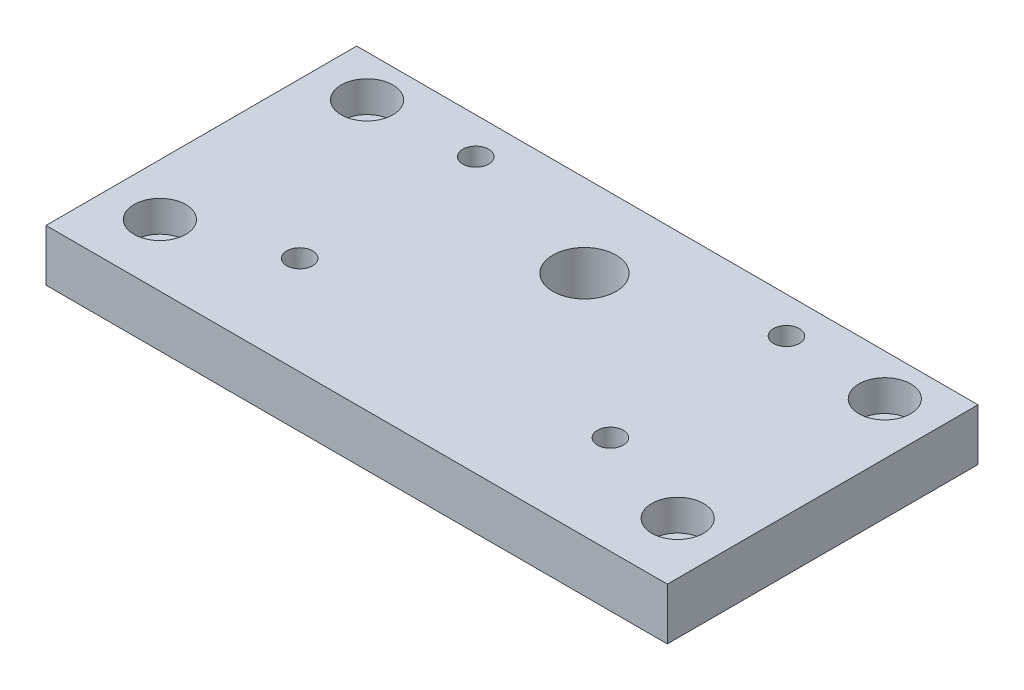
ISO-10303-21;
HEADER;
FILE_DESCRIPTION(('STEP AP214'),'2;1');
FILE_NAME('part.step','',(''),(''),'','','');
FILE_SCHEMA(('AUTOMOTIVE_DESIGN { 1 0 10303 214 1 1 1 1 }'));
ENDSEC;
DATA;
#1=APPLICATION_CONTEXT('core data for automotive mechanical design processes');
#2=APPLICATION_PROTOCOL_DEFINITION('international standard','automotive_design',2000,#1);
#3=PRODUCT_CONTEXT('',#1,'mechanical');
#4=PRODUCT('Part','Part','',(#3));
#5=PRODUCT_RELATED_PRODUCT_CATEGORY('part','',(#4));
#6=PRODUCT_DEFINITION_FORMATION('','',#4);
#7=PRODUCT_DEFINITION_CONTEXT('part definition',#1,'design');
#8=PRODUCT_DEFINITION('design','',#6,#7);
#9=PRODUCT_DEFINITION_SHAPE('','',#8);
#10=(LENGTH_UNIT() NAMED_UNIT(*) SI_UNIT(.MILLI.,.METRE.));
#11=(NAMED_UNIT(*) PLANE_ANGLE_UNIT() SI_UNIT($,.RADIAN.));
#12=(NAMED_UNIT(*) SI_UNIT($,.STERADIAN.) SOLID_ANGLE_UNIT());
#13=UNCERTAINTY_MEASURE_WITH_UNIT(LENGTH_MEASURE(1.E-05),#10,'distance_accuracy_value','');
#14=(GEOMETRIC_REPRESENTATION_CONTEXT(3) GLOBAL_UNCERTAINTY_ASSIGNED_CONTEXT((#13)) GLOBAL_UNIT_ASSIGNED_CONTEXT((#10,
#11,#12)) REPRESENTATION_CONTEXT('',''));
#15=CARTESIAN_POINT('',(0.,0.,0.));
#16=DIRECTION('',(0.,0.,1.));
#17=DIRECTION('',(1.,0.,0.));
#18=AXIS2_PLACEMENT_3D('',#15,#16,#17);
#19=CARTESIAN_POINT('',(5.,0.,-6.));
#20=DIRECTION('',(0.,1.,0.));
#21=DIRECTION('',(0.,0.,1.));
#22=AXIS2_PLACEMENT_3D('',#19,#20,#21);
#23=CYLINDRICAL_SURFACE('',#22,1.25);
#24=CARTESIAN_POINT('',(5.,0.,-6.));
#25=DIRECTION('',(0.,-1.,0.));
#26=DIRECTION('',(0.,0.,1.));
#27=AXIS2_PLACEMENT_3D('',#24,#25,#26);
#28=CIRCLE('',#27,1.25);
#29=CARTESIAN_POINT('',(5.,0.,-4.74999999999999));
#30=VERTEX_POINT('',#29);
#31=EDGE_CURVE('E115',#30,#30,#28,.T.);
#32=ORIENTED_EDGE('',*,*,#31,.T.);
#33=EDGE_LOOP('',(#32));
#34=FACE_BOUND('',#33,.T.);
#35=CARTESIAN_POINT('',(5.,2.,-6.));
#36=DIRECTION('',(0.,1.,0.));
#37=DIRECTION('',(0.,0.,1.));
#38=AXIS2_PLACEMENT_3D('',#35,#36,#37);
#39=CIRCLE('',#38,1.25);
#40=CARTESIAN_POINT('',(5.,2.,-4.74999999999999));
#41=VERTEX_POINT('',#40);
#42=EDGE_CURVE('E37',#41,#41,#39,.T.);
#43=ORIENTED_EDGE('',*,*,#42,.T.);
#44=EDGE_LOOP('',(#43));
#45=FACE_BOUND('',#44,.T.);
#46=ADVANCED_FACE('F33',(#34,#45),#23,.F.);
#47=CARTESIAN_POINT('',(5.,0.,-26.));
#48=DIRECTION('',(0.,1.,0.));
#49=DIRECTION('',(0.,0.,1.));
#50=AXIS2_PLACEMENT_3D('',#47,#48,#49);
#51=CYLINDRICAL_SURFACE('',#50,1.25);
#52=CARTESIAN_POINT('',(5.,0.,-26.));
#53=DIRECTION('',(0.,-1.,0.));
#54=DIRECTION('',(0.,0.,1.));
#55=AXIS2_PLACEMENT_3D('',#52,#53,#54);
#56=CIRCLE('',#55,1.25);
#57=CARTESIAN_POINT('',(5.,0.,-24.75));
#58=VERTEX_POINT('',#57);
#59=EDGE_CURVE('E147',#58,#58,#56,.T.);
#60=ORIENTED_EDGE('',*,*,#59,.T.);
#61=EDGE_LOOP('',(#60));
#62=FACE_BOUND('',#61,.T.);
#63=CARTESIAN_POINT('',(5.,2.,-26.));
#64=DIRECTION('',(0.,1.,0.));
#65=DIRECTION('',(0.,0.,1.));
#66=AXIS2_PLACEMENT_3D('',#63,#64,#65);
#67=CIRCLE('',#66,1.25);
#68=CARTESIAN_POINT('',(5.,2.,-24.75));
#69=VERTEX_POINT('',#68);
#70=EDGE_CURVE('E116',#69,#69,#67,.T.);
#71=ORIENTED_EDGE('',*,*,#70,.T.);
#72=EDGE_LOOP('',(#71));
#73=FACE_BOUND('',#72,.T.);
#74=ADVANCED_FACE('F205',(#62,#73),#51,.F.);
#75=CARTESIAN_POINT('',(55.,0.,-6.));
#76=DIRECTION('',(0.,1.,0.));
#77=DIRECTION('',(0.,0.,1.));
#78=AXIS2_PLACEMENT_3D('',#75,#76,#77);
#79=CYLINDRICAL_SURFACE('',#78,1.25);
#80=CARTESIAN_POINT('',(55.,0.,-6.));
#81=DIRECTION('',(0.,1.,0.));
#82=DIRECTION('',(0.,0.,1.));
#83=AXIS2_PLACEMENT_3D('',#80,#81,#82);
#84=CIRCLE('',#83,1.25);
#85=CARTESIAN_POINT('',(55.,0.,-4.74999999999999));
#86=VERTEX_POINT('',#85);
#87=EDGE_CURVE('E150',#86,#86,#84,.T.);
#88=ORIENTED_EDGE('',*,*,#87,.F.);
#89=EDGE_LOOP('',(#88));
#90=FACE_BOUND('',#89,.T.);
#91=CARTESIAN_POINT('',(55.,2.,-6.));
#92=DIRECTION('',(0.,1.,0.));
#93=DIRECTION('',(0.,0.,1.));
#94=AXIS2_PLACEMENT_3D('',#91,#92,#93);
#95=CIRCLE('',#94,1.25);
#96=CARTESIAN_POINT('',(55.,2.,-4.74999999999999));
#97=VERTEX_POINT('',#96);
#98=EDGE_CURVE('E112',#97,#97,#95,.F.);
#99=ORIENTED_EDGE('',*,*,#98,.F.);
#100=EDGE_LOOP('',(#99));
#101=FACE_BOUND('',#100,.T.);
#102=ADVANCED_FACE('F211',(#90,#101),#79,.F.);
#103=CARTESIAN_POINT('',(55.,0.,-26.));
#104=DIRECTION('',(0.,1.,0.));
#105=DIRECTION('',(0.,0.,1.));
#106=AXIS2_PLACEMENT_3D('',#103,#104,#105);
#107=CYLINDRICAL_SURFACE('',#106,1.25);
#108=CARTESIAN_POINT('',(55.,0.,-26.));
#109=DIRECTION('',(0.,1.,0.));
#110=DIRECTION('',(0.,0.,1.));
#111=AXIS2_PLACEMENT_3D('',#108,#109,#110);
#112=CIRCLE('',#111,1.25);
#113=CARTESIAN_POINT('',(55.,0.,-24.75));
#114=VERTEX_POINT('',#113);
#115=EDGE_CURVE('E153',#114,#114,#112,.T.);
#116=ORIENTED_EDGE('',*,*,#115,.F.);
#117=EDGE_LOOP('',(#116));
#118=FACE_BOUND('',#117,.T.);
#119=CARTESIAN_POINT('',(55.,2.,-26.));
#120=DIRECTION('',(0.,1.,0.));
#121=DIRECTION('',(0.,0.,1.));
#122=AXIS2_PLACEMENT_3D('',#119,#120,#121);
#123=CIRCLE('',#122,1.25);
#124=CARTESIAN_POINT('',(55.,2.,-24.75));
#125=VERTEX_POINT('',#124);
#126=EDGE_CURVE('E109',#125,#125,#123,.F.);
#127=ORIENTED_EDGE('',*,*,#126,.F.);
#128=EDGE_LOOP('',(#127));
#129=FACE_BOUND('',#128,.T.);
#130=ADVANCED_FACE('F217',(#118,#129),#107,.F.);
#131=CARTESIAN_POINT('',(0.,5.,0.));
#132=DIRECTION('',(1.,0.,0.));
#133=DIRECTION('',(0.,0.,-1.));
#134=AXIS2_PLACEMENT_3D('',#131,#132,#133);
#135=PLANE('',#134);
#136=DIRECTION('',(0.,0.,1.));
#137=VECTOR('',#136,1.);
#138=CARTESIAN_POINT('',(0.,0.,0.));
#139=LINE('',#138,#137);
#140=CARTESIAN_POINT('',(0.,0.,-30.));
#141=VERTEX_POINT('',#140);
#142=CARTESIAN_POINT('',(0.,0.,0.));
#143=VERTEX_POINT('',#142);
#144=EDGE_CURVE('E100',#141,#143,#139,.T.);
#145=ORIENTED_EDGE('',*,*,#144,.T.);
#146=DIRECTION('',(0.,-1.,0.));
#147=VECTOR('',#146,1.);
#148=CARTESIAN_POINT('',(0.,5.,0.));
#149=LINE('',#148,#147);
#150=CARTESIAN_POINT('',(0.,5.,0.));
#151=VERTEX_POINT('',#150);
#152=EDGE_CURVE('E11',#151,#143,#149,.T.);
#153=ORIENTED_EDGE('',*,*,#152,.F.);
#154=DIRECTION('',(0.,0.,1.));
#155=VECTOR('',#154,1.);
#156=CARTESIAN_POINT('',(0.,5.,0.));
#157=LINE('',#156,#155);
#158=CARTESIAN_POINT('',(0.,5.,-30.));
#159=VERTEX_POINT('',#158);
#160=EDGE_CURVE('E87',#159,#151,#157,.T.);
#161=ORIENTED_EDGE('',*,*,#160,.F.);
#162=DIRECTION('',(0.,-1.,0.));
#163=VECTOR('',#162,1.);
#164=CARTESIAN_POINT('',(0.,5.,-30.));
#165=LINE('',#164,#163);
#166=EDGE_CURVE('E96',#159,#141,#165,.T.);
#167=ORIENTED_EDGE('',*,*,#166,.T.);
#168=EDGE_LOOP('',(#145,#153,#161,#167));
#169=FACE_BOUND('',#168,.T.);
#170=ADVANCED_FACE('F35',(#169),#135,.F.);
#171=CARTESIAN_POINT('',(0.,5.,0.));
#172=DIRECTION('',(0.,0.,-1.));
#173=DIRECTION('',(-1.,0.,0.));
#174=AXIS2_PLACEMENT_3D('',#171,#172,#173);
#175=PLANE('',#174);
#176=DIRECTION('',(1.,0.,0.));
#177=VECTOR('',#176,1.);
#178=CARTESIAN_POINT('',(0.,0.,0.));
#179=LINE('',#178,#177);
#180=CARTESIAN_POINT('',(60.,0.,0.));
#181=VERTEX_POINT('',#180);
#182=EDGE_CURVE('E91',#143,#181,#179,.T.);
#183=ORIENTED_EDGE('',*,*,#182,.T.);
#184=DIRECTION('',(0.,-1.,0.));
#185=VECTOR('',#184,1.);
#186=CARTESIAN_POINT('',(60.,5.,0.));
#187=LINE('',#186,#185);
#188=CARTESIAN_POINT('',(60.,5.,0.));
#189=VERTEX_POINT('',#188);
#190=EDGE_CURVE('E43',#189,#181,#187,.T.);
#191=ORIENTED_EDGE('',*,*,#190,.F.);
#192=DIRECTION('',(1.,0.,0.));
#193=VECTOR('',#192,1.);
#194=CARTESIAN_POINT('',(0.,5.,0.));
#195=LINE('',#194,#193);
#196=EDGE_CURVE('E82',#151,#189,#195,.T.);
#197=ORIENTED_EDGE('',*,*,#196,.F.);
#198=ORIENTED_EDGE('',*,*,#152,.T.);
#199=EDGE_LOOP('',(#183,#191,#197,#198));
#200=FACE_BOUND('',#199,.T.);
#201=ADVANCED_FACE('F90',(#200),#175,.F.);
#202=CARTESIAN_POINT('',(60.,5.,0.));
#203=DIRECTION('',(-1.,0.,0.));
#204=DIRECTION('',(0.,0.,1.));
#205=AXIS2_PLACEMENT_3D('',#202,#203,#204);
#206=PLANE('',#205);
#207=DIRECTION('',(0.,0.,-1.));
#208=VECTOR('',#207,1.);
#209=CARTESIAN_POINT('',(60.,0.,0.));
#210=LINE('',#209,#208);
#211=CARTESIAN_POINT('',(60.,0.,-30.));
#212=VERTEX_POINT('',#211);
#213=EDGE_CURVE('E69',#181,#212,#210,.T.);
#214=ORIENTED_EDGE('',*,*,#213,.T.);
#215=DIRECTION('',(0.,-1.,0.));
#216=VECTOR('',#215,1.);
#217=CARTESIAN_POINT('',(60.,5.,-30.));
#218=LINE('',#217,#216);
#219=CARTESIAN_POINT('',(60.,5.,-30.));
#220=VERTEX_POINT('',#219);
#221=EDGE_CURVE('E92',#220,#212,#218,.T.);
#222=ORIENTED_EDGE('',*,*,#221,.F.);
#223=DIRECTION('',(0.,0.,-1.));
#224=VECTOR('',#223,1.);
#225=CARTESIAN_POINT('',(60.,5.,0.));
#226=LINE('',#225,#224);
#227=EDGE_CURVE('E85',#189,#220,#226,.T.);
#228=ORIENTED_EDGE('',*,*,#227,.F.);
#229=ORIENTED_EDGE('',*,*,#190,.T.);
#230=EDGE_LOOP('',(#214,#222,#228,#229));
#231=FACE_BOUND('',#230,.T.);
#232=ADVANCED_FACE('F94',(#231),#206,.F.);
#233=CARTESIAN_POINT('',(0.,5.,-30.));
#234=DIRECTION('',(0.,0.,1.));
#235=DIRECTION('',(1.,0.,0.));
#236=AXIS2_PLACEMENT_3D('',#233,#234,#235);
#237=PLANE('',#236);
#238=DIRECTION('',(-1.,0.,0.));
#239=VECTOR('',#238,1.);
#240=CARTESIAN_POINT('',(0.,0.,-30.));
#241=LINE('',#240,#239);
#242=EDGE_CURVE('E75',#212,#141,#241,.T.);
#243=ORIENTED_EDGE('',*,*,#242,.T.);
#244=ORIENTED_EDGE('',*,*,#166,.F.);
#245=DIRECTION('',(-1.,0.,0.));
#246=VECTOR('',#245,1.);
#247=CARTESIAN_POINT('',(0.,5.,-30.));
#248=LINE('',#247,#246);
#249=EDGE_CURVE('E52',#220,#159,#248,.T.);
#250=ORIENTED_EDGE('',*,*,#249,.F.);
#251=ORIENTED_EDGE('',*,*,#221,.T.);
#252=EDGE_LOOP('',(#243,#244,#250,#251));
#253=FACE_BOUND('',#252,.T.);
#254=ADVANCED_FACE('F192',(#253),#237,.F.);
#255=CARTESIAN_POINT('',(0.,5.,0.));
#256=DIRECTION('',(0.,-1.,0.));
#257=DIRECTION('',(0.,0.,-1.));
#258=AXIS2_PLACEMENT_3D('',#255,#256,#257);
#259=PLANE('',#258);
#260=CARTESIAN_POINT('',(5.,5.,-26.));
#261=DIRECTION('',(0.,-1.,0.));
#262=DIRECTION('',(0.,0.,1.));
#263=AXIS2_PLACEMENT_3D('',#260,#261,#262);
#264=CIRCLE('',#263,2.5);
#265=CARTESIAN_POINT('',(5.,5.,-23.5));
#266=VERTEX_POINT('',#265);
#267=EDGE_CURVE('E124',#266,#266,#264,.T.);
#268=ORIENTED_EDGE('',*,*,#267,.T.);
#269=EDGE_LOOP('',(#268));
#270=FACE_BOUND('',#269,.T.);
#271=CARTESIAN_POINT('',(5.,5.,-6.));
#272=DIRECTION('',(0.,-1.,0.));
#273=DIRECTION('',(0.,0.,1.));
#274=AXIS2_PLACEMENT_3D('',#271,#272,#273);
#275=CIRCLE('',#274,2.5);
#276=CARTESIAN_POINT('',(5.,5.,-3.5));
#277=VERTEX_POINT('',#276);
#278=EDGE_CURVE('E134',#277,#277,#275,.T.);
#279=ORIENTED_EDGE('',*,*,#278,.T.);
#280=EDGE_LOOP('',(#279));
#281=FACE_BOUND('',#280,.T.);
#282=CARTESIAN_POINT('',(55.,5.,-26.));
#283=DIRECTION('',(0.,1.,0.));
#284=DIRECTION('',(0.,0.,1.));
#285=AXIS2_PLACEMENT_3D('',#282,#283,#284);
#286=CIRCLE('',#285,2.5);
#287=CARTESIAN_POINT('',(55.,5.,-23.5));
#288=VERTEX_POINT('',#287);
#289=EDGE_CURVE('E139',#288,#288,#286,.T.);
#290=ORIENTED_EDGE('',*,*,#289,.F.);
#291=EDGE_LOOP('',(#290));
#292=FACE_BOUND('',#291,.T.);
#293=CARTESIAN_POINT('',(55.,5.,-6.));
#294=DIRECTION('',(0.,1.,0.));
#295=DIRECTION('',(0.,0.,1.));
#296=AXIS2_PLACEMENT_3D('',#293,#294,#295);
#297=CIRCLE('',#296,2.5);
#298=CARTESIAN_POINT('',(55.,5.,-3.5));
#299=VERTEX_POINT('',#298);
#300=EDGE_CURVE('E122',#299,#299,#297,.T.);
#301=ORIENTED_EDGE('',*,*,#300,.F.);
#302=EDGE_LOOP('',(#301));
#303=FACE_BOUND('',#302,.T.);
#304=CARTESIAN_POINT('',(15.,5.,-26.5));
#305=DIRECTION('',(0.,-1.,0.));
#306=DIRECTION('',(0.,0.,1.));
#307=AXIS2_PLACEMENT_3D('',#304,#305,#306);
#308=CIRCLE('',#307,1.25);
#309=CARTESIAN_POINT('',(15.,5.,-25.25));
#310=VERTEX_POINT('',#309);
#311=EDGE_CURVE('E163',#310,#310,#308,.T.);
#312=ORIENTED_EDGE('',*,*,#311,.T.);
#313=EDGE_LOOP('',(#312));
#314=FACE_BOUND('',#313,.T.);
#315=CARTESIAN_POINT('',(15.,5.,-9.5));
#316=DIRECTION('',(0.,-1.,0.));
#317=DIRECTION('',(0.,0.,1.));
#318=AXIS2_PLACEMENT_3D('',#315,#316,#317);
#319=CIRCLE('',#318,1.25);
#320=CARTESIAN_POINT('',(15.,5.,-8.25));
#321=VERTEX_POINT('',#320);
#322=EDGE_CURVE('E156',#321,#321,#319,.T.);
#323=ORIENTED_EDGE('',*,*,#322,.T.);
#324=EDGE_LOOP('',(#323));
#325=FACE_BOUND('',#324,.T.);
#326=CARTESIAN_POINT('',(30.,5.,-22.));
#327=DIRECTION('',(0.,1.,0.));
#328=DIRECTION('',(0.,0.,1.));
#329=AXIS2_PLACEMENT_3D('',#326,#327,#328);
#330=CIRCLE('',#329,3.05000000000001);
#331=CARTESIAN_POINT('',(30.,5.,-18.95));
#332=VERTEX_POINT('',#331);
#333=EDGE_CURVE('E173',#332,#332,#330,.T.);
#334=ORIENTED_EDGE('',*,*,#333,.F.);
#335=EDGE_LOOP('',(#334));
#336=FACE_BOUND('',#335,.T.);
#337=CARTESIAN_POINT('',(45.,5.,-26.5));
#338=DIRECTION('',(0.,1.,0.));
#339=DIRECTION('',(0.,0.,1.));
#340=AXIS2_PLACEMENT_3D('',#337,#338,#339);
#341=CIRCLE('',#340,1.25);
#342=CARTESIAN_POINT('',(45.,5.,-25.25));
#343=VERTEX_POINT('',#342);
#344=EDGE_CURVE('E179',#343,#343,#341,.T.);
#345=ORIENTED_EDGE('',*,*,#344,.F.);
#346=EDGE_LOOP('',(#345));
#347=FACE_BOUND('',#346,.T.);
#348=CARTESIAN_POINT('',(45.,5.,-9.5));
#349=DIRECTION('',(0.,1.,0.));
#350=DIRECTION('',(0.,0.,1.));
#351=AXIS2_PLACEMENT_3D('',#348,#349,#350);
#352=CIRCLE('',#351,1.25);
#353=CARTESIAN_POINT('',(45.,5.,-8.25));
#354=VERTEX_POINT('',#353);
#355=EDGE_CURVE('E162',#354,#354,#352,.T.);
#356=ORIENTED_EDGE('',*,*,#355,.F.);
#357=EDGE_LOOP('',(#356));
#358=FACE_BOUND('',#357,.T.);
#359=ORIENTED_EDGE('',*,*,#160,.T.);
#360=ORIENTED_EDGE('',*,*,#196,.T.);
#361=ORIENTED_EDGE('',*,*,#227,.T.);
#362=ORIENTED_EDGE('',*,*,#249,.T.);
#363=EDGE_LOOP('',(#359,#360,#361,#362));
#364=FACE_BOUND('',#363,.T.);
#365=ADVANCED_FACE('F83',(#270,#281,#292,#303,#314,#325,#336,#347,#358,#364),#259,.F.);
#366=CARTESIAN_POINT('',(0.,0.,0.));
#367=DIRECTION('',(0.,-1.,0.));
#368=DIRECTION('',(0.,0.,-1.));
#369=AXIS2_PLACEMENT_3D('',#366,#367,#368);
#370=PLANE('',#369);
#371=ORIENTED_EDGE('',*,*,#59,.F.);
#372=EDGE_LOOP('',(#371));
#373=FACE_BOUND('',#372,.T.);
#374=ORIENTED_EDGE('',*,*,#31,.F.);
#375=EDGE_LOOP('',(#374));
#376=FACE_BOUND('',#375,.T.);
#377=ORIENTED_EDGE('',*,*,#115,.T.);
#378=EDGE_LOOP('',(#377));
#379=FACE_BOUND('',#378,.T.);
#380=ORIENTED_EDGE('',*,*,#87,.T.);
#381=EDGE_LOOP('',(#380));
#382=FACE_BOUND('',#381,.T.);
#383=CARTESIAN_POINT('',(15.,0.,-26.5));
#384=DIRECTION('',(0.,-1.,0.));
#385=DIRECTION('',(0.,0.,1.));
#386=AXIS2_PLACEMENT_3D('',#383,#384,#385);
#387=CIRCLE('',#386,1.25);
#388=CARTESIAN_POINT('',(15.,0.,-25.25));
#389=VERTEX_POINT('',#388);
#390=EDGE_CURVE('E159',#389,#389,#387,.T.);
#391=ORIENTED_EDGE('',*,*,#390,.F.);
#392=EDGE_LOOP('',(#391));
#393=FACE_BOUND('',#392,.T.);
#394=CARTESIAN_POINT('',(15.,0.,-9.5));
#395=DIRECTION('',(0.,-1.,0.));
#396=DIRECTION('',(0.,0.,1.));
#397=AXIS2_PLACEMENT_3D('',#394,#395,#396);
#398=CIRCLE('',#397,1.25);
#399=CARTESIAN_POINT('',(15.,0.,-8.25));
#400=VERTEX_POINT('',#399);
#401=EDGE_CURVE('E166',#400,#400,#398,.T.);
#402=ORIENTED_EDGE('',*,*,#401,.F.);
#403=EDGE_LOOP('',(#402));
#404=FACE_BOUND('',#403,.T.);
#405=CARTESIAN_POINT('',(30.,0.,-22.));
#406=DIRECTION('',(0.,1.,0.));
#407=DIRECTION('',(0.,0.,1.));
#408=AXIS2_PLACEMENT_3D('',#405,#406,#407);
#409=CIRCLE('',#408,3.05000000000001);
#410=CARTESIAN_POINT('',(30.,0.,-18.95));
#411=VERTEX_POINT('',#410);
#412=EDGE_CURVE('E103',#411,#411,#409,.T.);
#413=ORIENTED_EDGE('',*,*,#412,.T.);
#414=EDGE_LOOP('',(#413));
#415=FACE_BOUND('',#414,.T.);
#416=CARTESIAN_POINT('',(45.,0.,-26.5));
#417=DIRECTION('',(0.,1.,0.));
#418=DIRECTION('',(0.,0.,1.));
#419=AXIS2_PLACEMENT_3D('',#416,#417,#418);
#420=CIRCLE('',#419,1.25);
#421=CARTESIAN_POINT('',(45.,0.,-25.25));
#422=VERTEX_POINT('',#421);
#423=EDGE_CURVE('E176',#422,#422,#420,.T.);
#424=ORIENTED_EDGE('',*,*,#423,.T.);
#425=EDGE_LOOP('',(#424));
#426=FACE_BOUND('',#425,.T.);
#427=CARTESIAN_POINT('',(45.,0.,-9.5));
#428=DIRECTION('',(0.,1.,0.));
#429=DIRECTION('',(0.,0.,1.));
#430=AXIS2_PLACEMENT_3D('',#427,#428,#429);
#431=CIRCLE('',#430,1.25);
#432=CARTESIAN_POINT('',(45.,0.,-8.25));
#433=VERTEX_POINT('',#432);
#434=EDGE_CURVE('E182',#433,#433,#431,.T.);
#435=ORIENTED_EDGE('',*,*,#434,.T.);
#436=EDGE_LOOP('',(#435));
#437=FACE_BOUND('',#436,.T.);
#438=ORIENTED_EDGE('',*,*,#144,.F.);
#439=ORIENTED_EDGE('',*,*,#242,.F.);
#440=ORIENTED_EDGE('',*,*,#213,.F.);
#441=ORIENTED_EDGE('',*,*,#182,.F.);
#442=EDGE_LOOP('',(#438,#439,#440,#441));
#443=FACE_BOUND('',#442,.T.);
#444=ADVANCED_FACE('F191',(#373,#376,#379,#382,#393,#404,#415,#426,#437,#443),#370,.T.);
#445=CARTESIAN_POINT('',(45.,0.,-9.5));
#446=DIRECTION('',(0.,1.,0.));
#447=DIRECTION('',(0.,0.,1.));
#448=AXIS2_PLACEMENT_3D('',#445,#446,#447);
#449=CYLINDRICAL_SURFACE('',#448,1.25);
#450=ORIENTED_EDGE('',*,*,#434,.F.);
#451=EDGE_LOOP('',(#450));
#452=FACE_BOUND('',#451,.T.);
#453=ORIENTED_EDGE('',*,*,#355,.T.);
#454=EDGE_LOOP('',(#453));
#455=FACE_BOUND('',#454,.T.);
#456=ADVANCED_FACE('F188',(#452,#455),#449,.F.);
#457=CARTESIAN_POINT('',(45.,0.,-26.5));
#458=DIRECTION('',(0.,1.,0.));
#459=DIRECTION('',(0.,0.,1.));
#460=AXIS2_PLACEMENT_3D('',#457,#458,#459);
#461=CYLINDRICAL_SURFACE('',#460,1.25);
#462=ORIENTED_EDGE('',*,*,#423,.F.);
#463=EDGE_LOOP('',(#462));
#464=FACE_BOUND('',#463,.T.);
#465=ORIENTED_EDGE('',*,*,#344,.T.);
#466=EDGE_LOOP('',(#465));
#467=FACE_BOUND('',#466,.T.);
#468=ADVANCED_FACE('F236',(#464,#467),#461,.F.);
#469=CARTESIAN_POINT('',(30.,0.,-22.));
#470=DIRECTION('',(0.,1.,0.));
#471=DIRECTION('',(0.,0.,1.));
#472=AXIS2_PLACEMENT_3D('',#469,#470,#471);
#473=CYLINDRICAL_SURFACE('',#472,3.05000000000001);
#474=ORIENTED_EDGE('',*,*,#412,.F.);
#475=EDGE_LOOP('',(#474));
#476=FACE_BOUND('',#475,.T.);
#477=ORIENTED_EDGE('',*,*,#333,.T.);
#478=EDGE_LOOP('',(#477));
#479=FACE_BOUND('',#478,.T.);
#480=ADVANCED_FACE('F232',(#476,#479),#473,.F.);
#481=CARTESIAN_POINT('',(15.,0.,-9.5));
#482=DIRECTION('',(0.,1.,0.));
#483=DIRECTION('',(0.,0.,1.));
#484=AXIS2_PLACEMENT_3D('',#481,#482,#483);
#485=CYLINDRICAL_SURFACE('',#484,1.25);
#486=ORIENTED_EDGE('',*,*,#401,.T.);
#487=EDGE_LOOP('',(#486));
#488=FACE_BOUND('',#487,.T.);
#489=ORIENTED_EDGE('',*,*,#322,.F.);
#490=EDGE_LOOP('',(#489));
#491=FACE_BOUND('',#490,.T.);
#492=ADVANCED_FACE('F228',(#488,#491),#485,.F.);
#493=CARTESIAN_POINT('',(15.,0.,-26.5));
#494=DIRECTION('',(0.,1.,0.));
#495=DIRECTION('',(0.,0.,1.));
#496=AXIS2_PLACEMENT_3D('',#493,#494,#495);
#497=CYLINDRICAL_SURFACE('',#496,1.25);
#498=ORIENTED_EDGE('',*,*,#390,.T.);
#499=EDGE_LOOP('',(#498));
#500=FACE_BOUND('',#499,.T.);
#501=ORIENTED_EDGE('',*,*,#311,.F.);
#502=EDGE_LOOP('',(#501));
#503=FACE_BOUND('',#502,.T.);
#504=ADVANCED_FACE('F224',(#500,#503),#497,.F.);
#505=CARTESIAN_POINT('',(55.,2.,-26.));
#506=DIRECTION('',(0.,1.,0.));
#507=DIRECTION('',(0.,0.,1.));
#508=AXIS2_PLACEMENT_3D('',#505,#506,#507);
#509=PLANE('',#508);
#510=CARTESIAN_POINT('',(55.,2.,-26.));
#511=DIRECTION('',(0.,1.,0.));
#512=DIRECTION('',(0.,0.,1.));
#513=AXIS2_PLACEMENT_3D('',#510,#511,#512);
#514=CIRCLE('',#513,2.5);
#515=CARTESIAN_POINT('',(55.,2.,-23.5));
#516=VERTEX_POINT('',#515);
#517=EDGE_CURVE('E113',#516,#516,#514,.T.);
#518=ORIENTED_EDGE('',*,*,#517,.T.);
#519=EDGE_LOOP('',(#518));
#520=FACE_BOUND('',#519,.T.);
#521=ORIENTED_EDGE('',*,*,#126,.T.);
#522=EDGE_LOOP('',(#521));
#523=FACE_BOUND('',#522,.T.);
#524=ADVANCED_FACE('F227',(#520,#523),#509,.T.);
#525=CARTESIAN_POINT('',(55.,2.,-26.));
#526=DIRECTION('',(0.,1.,0.));
#527=DIRECTION('',(0.,0.,1.));
#528=AXIS2_PLACEMENT_3D('',#525,#526,#527);
#529=CYLINDRICAL_SURFACE('',#528,2.5);
#530=ORIENTED_EDGE('',*,*,#517,.F.);
#531=EDGE_LOOP('',(#530));
#532=FACE_BOUND('',#531,.T.);
#533=ORIENTED_EDGE('',*,*,#289,.T.);
#534=EDGE_LOOP('',(#533));
#535=FACE_BOUND('',#534,.T.);
#536=ADVANCED_FACE('F319',(#532,#535),#529,.F.);
#537=CARTESIAN_POINT('',(55.,2.,-6.));
#538=DIRECTION('',(0.,1.,0.));
#539=DIRECTION('',(0.,0.,1.));
#540=AXIS2_PLACEMENT_3D('',#537,#538,#539);
#541=PLANE('',#540);
#542=CARTESIAN_POINT('',(55.,2.,-6.));
#543=DIRECTION('',(0.,1.,0.));
#544=DIRECTION('',(0.,0.,1.));
#545=AXIS2_PLACEMENT_3D('',#542,#543,#544);
#546=CIRCLE('',#545,2.5);
#547=CARTESIAN_POINT('',(55.,2.,-3.5));
#548=VERTEX_POINT('',#547);
#549=EDGE_CURVE('E142',#548,#548,#546,.T.);
#550=ORIENTED_EDGE('',*,*,#549,.T.);
#551=EDGE_LOOP('',(#550));
#552=FACE_BOUND('',#551,.T.);
#553=ORIENTED_EDGE('',*,*,#98,.T.);
#554=EDGE_LOOP('',(#553));
#555=FACE_BOUND('',#554,.T.);
#556=ADVANCED_FACE('F329',(#552,#555),#541,.T.);
#557=CARTESIAN_POINT('',(55.,2.,-6.));
#558=DIRECTION('',(0.,1.,0.));
#559=DIRECTION('',(0.,0.,1.));
#560=AXIS2_PLACEMENT_3D('',#557,#558,#559);
#561=CYLINDRICAL_SURFACE('',#560,2.5);
#562=ORIENTED_EDGE('',*,*,#549,.F.);
#563=EDGE_LOOP('',(#562));
#564=FACE_BOUND('',#563,.T.);
#565=ORIENTED_EDGE('',*,*,#300,.T.);
#566=EDGE_LOOP('',(#565));
#567=FACE_BOUND('',#566,.T.);
#568=ADVANCED_FACE('F339',(#564,#567),#561,.F.);
#569=CARTESIAN_POINT('',(5.,2.,-26.));
#570=DIRECTION('',(0.,1.,0.));
#571=DIRECTION('',(0.,0.,1.));
#572=AXIS2_PLACEMENT_3D('',#569,#570,#571);
#573=CYLINDRICAL_SURFACE('',#572,2.5);
#574=CARTESIAN_POINT('',(5.,2.,-26.));
#575=DIRECTION('',(0.,-1.,0.));
#576=DIRECTION('',(0.,0.,1.));
#577=AXIS2_PLACEMENT_3D('',#574,#575,#576);
#578=CIRCLE('',#577,2.5);
#579=CARTESIAN_POINT('',(5.,2.,-23.5));
#580=VERTEX_POINT('',#579);
#581=EDGE_CURVE('E118',#580,#580,#578,.T.);
#582=ORIENTED_EDGE('',*,*,#581,.T.);
#583=EDGE_LOOP('',(#582));
#584=FACE_BOUND('',#583,.T.);
#585=ORIENTED_EDGE('',*,*,#267,.F.);
#586=EDGE_LOOP('',(#585));
#587=FACE_BOUND('',#586,.T.);
#588=ADVANCED_FACE('F348',(#584,#587),#573,.F.);
#589=CARTESIAN_POINT('',(5.,2.,-26.));
#590=DIRECTION('',(0.,1.,0.));
#591=DIRECTION('',(0.,0.,1.));
#592=AXIS2_PLACEMENT_3D('',#589,#590,#591);
#593=PLANE('',#592);
#594=ORIENTED_EDGE('',*,*,#70,.F.);
#595=EDGE_LOOP('',(#594));
#596=FACE_BOUND('',#595,.T.);
#597=ORIENTED_EDGE('',*,*,#581,.F.);
#598=EDGE_LOOP('',(#597));
#599=FACE_BOUND('',#598,.T.);
#600=ADVANCED_FACE('F371',(#596,#599),#593,.T.);
#601=CARTESIAN_POINT('',(5.,2.,-6.));
#602=DIRECTION('',(0.,1.,0.));
#603=DIRECTION('',(0.,0.,1.));
#604=AXIS2_PLACEMENT_3D('',#601,#602,#603);
#605=CYLINDRICAL_SURFACE('',#604,2.5);
#606=CARTESIAN_POINT('',(5.,2.,-6.));
#607=DIRECTION('',(0.,-1.,0.));
#608=DIRECTION('',(0.,0.,1.));
#609=AXIS2_PLACEMENT_3D('',#606,#607,#608);
#610=CIRCLE('',#609,2.5);
#611=CARTESIAN_POINT('',(5.,2.,-3.5));
#612=VERTEX_POINT('',#611);
#613=EDGE_CURVE('E129',#612,#612,#610,.T.);
#614=ORIENTED_EDGE('',*,*,#613,.T.);
#615=EDGE_LOOP('',(#614));
#616=FACE_BOUND('',#615,.T.);
#617=ORIENTED_EDGE('',*,*,#278,.F.);
#618=EDGE_LOOP('',(#617));
#619=FACE_BOUND('',#618,.T.);
#620=ADVANCED_FACE('F380',(#616,#619),#605,.F.);
#621=CARTESIAN_POINT('',(5.,2.,-6.));
#622=DIRECTION('',(0.,1.,0.));
#623=DIRECTION('',(0.,0.,1.));
#624=AXIS2_PLACEMENT_3D('',#621,#622,#623);
#625=PLANE('',#624);
#626=ORIENTED_EDGE('',*,*,#42,.F.);
#627=EDGE_LOOP('',(#626));
#628=FACE_BOUND('',#627,.T.);
#629=ORIENTED_EDGE('',*,*,#613,.F.);
#630=EDGE_LOOP('',(#629));
#631=FACE_BOUND('',#630,.T.);
#632=ADVANCED_FACE('F390',(#628,#631),#625,.T.);
#633=CLOSED_SHELL('',(#46,#74,#102,#130,#170,#201,#232,#254,#365,#444,#456,#468,#480,#492,#504,
#524,#536,#556,#568,#588,#600,#620,#632));
#634=MANIFOLD_SOLID_BREP('B2',#633);
#635=ADVANCED_BREP_SHAPE_REPRESENTATION('',(#18,#634),#14);
#636=SHAPE_DEFINITION_REPRESENTATION(#9,#635);
ENDSEC;
END-ISO-10303-21;
